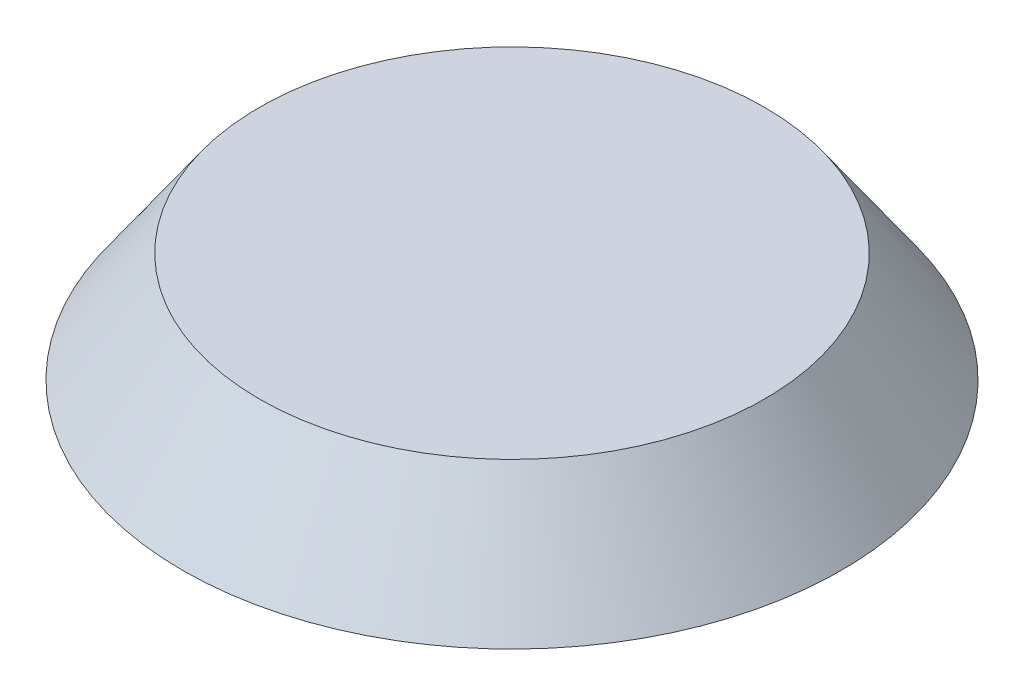
ISO-10303-21;
HEADER;
FILE_DESCRIPTION(('STEP AP214'),'2;1');
FILE_NAME('part.step','',(''),(''),'','','');
FILE_SCHEMA(('AUTOMOTIVE_DESIGN { 1 0 10303 214 1 1 1 1 }'));
ENDSEC;
DATA;
#1=APPLICATION_CONTEXT('core data for automotive mechanical design processes');
#2=APPLICATION_PROTOCOL_DEFINITION('international standard','automotive_design',2000,#1);
#3=PRODUCT_CONTEXT('',#1,'mechanical');
#4=PRODUCT('Part','Part','',(#3));
#5=PRODUCT_RELATED_PRODUCT_CATEGORY('part','',(#4));
#6=PRODUCT_DEFINITION_FORMATION('','',#4);
#7=PRODUCT_DEFINITION_CONTEXT('part definition',#1,'design');
#8=PRODUCT_DEFINITION('design','',#6,#7);
#9=PRODUCT_DEFINITION_SHAPE('','',#8);
#10=(LENGTH_UNIT() NAMED_UNIT(*) SI_UNIT(.MILLI.,.METRE.));
#11=(NAMED_UNIT(*) PLANE_ANGLE_UNIT() SI_UNIT($,.RADIAN.));
#12=(NAMED_UNIT(*) SI_UNIT($,.STERADIAN.) SOLID_ANGLE_UNIT());
#13=UNCERTAINTY_MEASURE_WITH_UNIT(LENGTH_MEASURE(1.E-05),#10,'distance_accuracy_value','');
#14=(GEOMETRIC_REPRESENTATION_CONTEXT(3) GLOBAL_UNCERTAINTY_ASSIGNED_CONTEXT((#13)) GLOBAL_UNIT_ASSIGNED_CONTEXT((#10,
#11,#12)) REPRESENTATION_CONTEXT('',''));
#15=CARTESIAN_POINT('',(0.,0.,0.));
#16=DIRECTION('',(0.,0.,1.));
#17=DIRECTION('',(1.,0.,0.));
#18=AXIS2_PLACEMENT_3D('',#15,#16,#17);
#19=CARTESIAN_POINT('',(0.,10.,0.));
#20=DIRECTION('',(0.,1.,0.));
#21=DIRECTION('',(0.,0.,1.));
#22=AXIS2_PLACEMENT_3D('',#19,#20,#21);
#23=PLANE('',#22);
#24=CARTESIAN_POINT('',(0.,10.,0.));
#25=DIRECTION('',(0.,1.,0.));
#26=DIRECTION('',(0.,0.,1.));
#27=AXIS2_PLACEMENT_3D('',#24,#25,#26);
#28=CIRCLE('',#27,22.9979246179029);
#29=CARTESIAN_POINT('',(0.,10.,22.9979246179029));
#30=VERTEX_POINT('',#29);
#31=EDGE_CURVE('E57',#30,#30,#28,.T.);
#32=ORIENTED_EDGE('',*,*,#31,.T.);
#33=EDGE_LOOP('',(#32));
#34=FACE_BOUND('',#33,.T.);
#35=ADVANCED_FACE('F31',(#34),#23,.T.);
#36=CARTESIAN_POINT('',(0.,0.,0.));
#37=DIRECTION('',(0.,1.,0.));
#38=DIRECTION('',(0.,0.,1.));
#39=AXIS2_PLACEMENT_3D('',#36,#37,#38);
#40=PLANE('',#39);
#41=CARTESIAN_POINT('',(0.,0.,0.));
#42=DIRECTION('',(0.,1.,0.));
#43=DIRECTION('',(0.,0.,1.));
#44=AXIS2_PLACEMENT_3D('',#41,#42,#43);
#45=CIRCLE('',#44,28.1688381168578);
#46=CARTESIAN_POINT('',(0.,0.,28.1688381168578));
#47=VERTEX_POINT('',#46);
#48=EDGE_CURVE('E64',#47,#47,#45,.T.);
#49=ORIENTED_EDGE('',*,*,#48,.T.);
#50=EDGE_LOOP('',(#49));
#51=FACE_BOUND('',#50,.T.);
#52=CARTESIAN_POINT('',(0.,0.,0.));
#53=DIRECTION('',(0.,1.,0.));
#54=DIRECTION('',(0.,0.,1.));
#55=AXIS2_PLACEMENT_3D('',#52,#53,#54);
#56=CIRCLE('',#55,30.);
#57=CARTESIAN_POINT('',(0.,0.,30.));
#58=VERTEX_POINT('',#57);
#59=EDGE_CURVE('E60',#58,#58,#56,.T.);
#60=ORIENTED_EDGE('',*,*,#59,.F.);
#61=EDGE_LOOP('',(#60));
#62=FACE_BOUND('',#61,.T.);
#63=ADVANCED_FACE('F112',(#51,#62),#40,.F.);
#64=CARTESIAN_POINT('',(0.,10.,0.));
#65=DIRECTION('',(0.,-1.,0.));
#66=DIRECTION('',(0.,0.,-1.));
#67=AXIS2_PLACEMENT_3D('',#64,#65,#66);
#68=CONICAL_SURFACE('',#67,22.9979246179029,0.610865238198013);
#69=ORIENTED_EDGE('',*,*,#59,.T.);
#70=EDGE_LOOP('',(#69));
#71=FACE_BOUND('',#70,.T.);
#72=ORIENTED_EDGE('',*,*,#31,.F.);
#73=EDGE_LOOP('',(#72));
#74=FACE_BOUND('',#73,.T.);
#75=ADVANCED_FACE('F118',(#71,#74),#68,.T.);
#76=CARTESIAN_POINT('',(0.,8.5,0.));
#77=DIRECTION('',(0.,1.,0.));
#78=DIRECTION('',(0.,0.,1.));
#79=AXIS2_PLACEMENT_3D('',#76,#77,#78);
#80=PLANE('',#79);
#81=CARTESIAN_POINT('',(7.99999999999987,8.5,-13.8564064605511));
#82=DIRECTION('',(0.,1.,0.));
#83=DIRECTION('',(0.,0.,1.));
#84=AXIS2_PLACEMENT_3D('',#81,#82,#83);
#85=CIRCLE('',#84,4.);
#86=CARTESIAN_POINT('',(7.99999999999987,8.5,-9.85640646055109));
#87=VERTEX_POINT('',#86);
#88=EDGE_CURVE('E42',#87,#87,#85,.F.);
#89=ORIENTED_EDGE('',*,*,#88,.F.);
#90=EDGE_LOOP('',(#89));
#91=FACE_BOUND('',#90,.T.);
#92=CARTESIAN_POINT('',(8.00000000000007,8.5,13.856406460551));
#93=DIRECTION('',(0.,1.,0.));
#94=DIRECTION('',(0.,0.,1.));
#95=AXIS2_PLACEMENT_3D('',#92,#93,#94);
#96=CIRCLE('',#95,4.);
#97=CARTESIAN_POINT('',(8.00000000000007,8.5,17.856406460551));
#98=VERTEX_POINT('',#97);
#99=EDGE_CURVE('E46',#98,#98,#96,.F.);
#100=ORIENTED_EDGE('',*,*,#99,.F.);
#101=EDGE_LOOP('',(#100));
#102=FACE_BOUND('',#101,.T.);
#103=CARTESIAN_POINT('',(-16.,8.5,0.));
#104=DIRECTION('',(0.,1.,0.));
#105=DIRECTION('',(0.,0.,1.));
#106=AXIS2_PLACEMENT_3D('',#103,#104,#105);
#107=CIRCLE('',#106,4.);
#108=CARTESIAN_POINT('',(-16.,8.5,4.));
#109=VERTEX_POINT('',#108);
#110=EDGE_CURVE('E54',#109,#109,#107,.F.);
#111=ORIENTED_EDGE('',*,*,#110,.F.);
#112=EDGE_LOOP('',(#111));
#113=FACE_BOUND('',#112,.T.);
#114=CARTESIAN_POINT('',(0.,8.5,0.));
#115=DIRECTION('',(0.,1.,0.));
#116=DIRECTION('',(0.,0.,1.));
#117=AXIS2_PLACEMENT_3D('',#114,#115,#116);
#118=CIRCLE('',#117,22.2170740420753);
#119=CARTESIAN_POINT('',(0.,8.5,22.2170740420753));
#120=VERTEX_POINT('',#119);
#121=EDGE_CURVE('E63',#120,#120,#118,.T.);
#122=ORIENTED_EDGE('',*,*,#121,.F.);
#123=EDGE_LOOP('',(#122));
#124=FACE_BOUND('',#123,.T.);
#125=ADVANCED_FACE('F127',(#91,#102,#113,#124),#80,.F.);
#126=CARTESIAN_POINT('',(0.,9.13963534547343,0.));
#127=DIRECTION('',(0.,-1.,0.));
#128=DIRECTION('',(0.,0.,-1.));
#129=AXIS2_PLACEMENT_3D('',#126,#127,#128);
#130=CONICAL_SURFACE('',#129,21.7691965514694,0.610865238198013);
#131=ORIENTED_EDGE('',*,*,#48,.F.);
#132=EDGE_LOOP('',(#131));
#133=FACE_BOUND('',#132,.T.);
#134=ORIENTED_EDGE('',*,*,#121,.T.);
#135=EDGE_LOOP('',(#134));
#136=FACE_BOUND('',#135,.T.);
#137=ADVANCED_FACE('F122',(#133,#136),#130,.F.);
#138=CARTESIAN_POINT('',(-16.,0.,0.));
#139=DIRECTION('',(0.,-1.,0.));
#140=DIRECTION('',(0.,0.,-1.));
#141=AXIS2_PLACEMENT_3D('',#138,#139,#140);
#142=PLANE('',#141);
#143=CARTESIAN_POINT('',(-16.,0.,0.));
#144=DIRECTION('',(0.,-1.,0.));
#145=DIRECTION('',(0.,0.,-1.));
#146=AXIS2_PLACEMENT_3D('',#143,#144,#145);
#147=CIRCLE('',#146,2.55453387609415);
#148=CARTESIAN_POINT('',(-16.,0.,-2.55453387609415));
#149=VERTEX_POINT('',#148);
#150=EDGE_CURVE('E70',#149,#149,#147,.T.);
#151=ORIENTED_EDGE('',*,*,#150,.F.);
#152=EDGE_LOOP('',(#151));
#153=FACE_BOUND('',#152,.T.);
#154=CARTESIAN_POINT('',(-16.,0.,0.));
#155=DIRECTION('',(0.,-1.,0.));
#156=DIRECTION('',(0.,0.,-1.));
#157=AXIS2_PLACEMENT_3D('',#154,#155,#156);
#158=CIRCLE('',#157,3.55453387609415);
#159=CARTESIAN_POINT('',(-16.,0.,-3.55453387609415));
#160=VERTEX_POINT('',#159);
#161=EDGE_CURVE('E51',#160,#160,#158,.T.);
#162=ORIENTED_EDGE('',*,*,#161,.T.);
#163=EDGE_LOOP('',(#162));
#164=FACE_BOUND('',#163,.T.);
#165=ADVANCED_FACE('F132',(#153,#164),#142,.T.);
#166=CARTESIAN_POINT('',(-16.,0.,0.));
#167=DIRECTION('',(0.,1.,0.));
#168=DIRECTION('',(0.,0.,1.));
#169=AXIS2_PLACEMENT_3D('',#166,#167,#168);
#170=CONICAL_SURFACE('',#169,3.55453387609415,0.0523598775598264);
#171=ORIENTED_EDGE('',*,*,#110,.T.);
#172=EDGE_LOOP('',(#171));
#173=FACE_BOUND('',#172,.T.);
#174=ORIENTED_EDGE('',*,*,#161,.F.);
#175=EDGE_LOOP('',(#174));
#176=FACE_BOUND('',#175,.T.);
#177=ADVANCED_FACE('F129',(#173,#176),#170,.T.);
#178=CARTESIAN_POINT('',(-16.,8.5,0.));
#179=DIRECTION('',(0.,-1.,0.));
#180=DIRECTION('',(0.,0.,-1.));
#181=AXIS2_PLACEMENT_3D('',#178,#179,#180);
#182=CYLINDRICAL_SURFACE('',#181,2.55453387609415);
#183=CARTESIAN_POINT('',(-16.,8.5,0.));
#184=DIRECTION('',(0.,-1.,0.));
#185=DIRECTION('',(0.,0.,-1.));
#186=AXIS2_PLACEMENT_3D('',#183,#184,#185);
#187=CIRCLE('',#186,2.55453387609415);
#188=CARTESIAN_POINT('',(-16.,8.5,-2.55453387609415));
#189=VERTEX_POINT('',#188);
#190=EDGE_CURVE('E67',#189,#189,#187,.T.);
#191=ORIENTED_EDGE('',*,*,#190,.F.);
#192=EDGE_LOOP('',(#191));
#193=FACE_BOUND('',#192,.T.);
#194=ORIENTED_EDGE('',*,*,#150,.T.);
#195=EDGE_LOOP('',(#194));
#196=FACE_BOUND('',#195,.T.);
#197=ADVANCED_FACE('F131',(#193,#196),#182,.F.);
#198=CARTESIAN_POINT('',(-16.,8.5,0.));
#199=DIRECTION('',(0.,-1.,0.));
#200=DIRECTION('',(0.,0.,-1.));
#201=AXIS2_PLACEMENT_3D('',#198,#199,#200);
#202=PLANE('',#201);
#203=ORIENTED_EDGE('',*,*,#190,.T.);
#204=EDGE_LOOP('',(#203));
#205=FACE_BOUND('',#204,.T.);
#206=ADVANCED_FACE('F107',(#205),#202,.T.);
#207=CARTESIAN_POINT('',(8.00000000000007,0.,13.856406460551));
#208=DIRECTION('',(0.,-1.,0.));
#209=DIRECTION('',(-0.866025403784436,0.,0.500000000000004));
#210=AXIS2_PLACEMENT_3D('',#207,#208,#209);
#211=PLANE('',#210);
#212=CARTESIAN_POINT('',(8.00000000000007,0.,13.856406460551));
#213=DIRECTION('',(0.,-1.,0.));
#214=DIRECTION('',(-0.866025403784436,0.,0.500000000000004));
#215=AXIS2_PLACEMENT_3D('',#212,#213,#214);
#216=CIRCLE('',#215,2.55453387609415);
#217=CARTESIAN_POINT('',(5.78770876847461,0.,15.1336733985981));
#218=VERTEX_POINT('',#217);
#219=EDGE_CURVE('E76',#218,#218,#216,.T.);
#220=ORIENTED_EDGE('',*,*,#219,.F.);
#221=EDGE_LOOP('',(#220));
#222=FACE_BOUND('',#221,.T.);
#223=CARTESIAN_POINT('',(8.00000000000007,0.,13.856406460551));
#224=DIRECTION('',(0.,-1.,0.));
#225=DIRECTION('',(0.,0.,-1.));
#226=AXIS2_PLACEMENT_3D('',#223,#224,#225);
#227=CIRCLE('',#226,3.55453387609415);
#228=CARTESIAN_POINT('',(8.00000000000007,0.,10.3018725844568));
#229=VERTEX_POINT('',#228);
#230=EDGE_CURVE('E38',#229,#229,#227,.T.);
#231=ORIENTED_EDGE('',*,*,#230,.T.);
#232=EDGE_LOOP('',(#231));
#233=FACE_BOUND('',#232,.T.);
#234=ADVANCED_FACE('F100',(#222,#233),#211,.T.);
#235=CARTESIAN_POINT('',(7.99999999999987,0.,-13.8564064605511));
#236=DIRECTION('',(0.,-1.,0.));
#237=DIRECTION('',(0.866025403784443,0.,0.499999999999992));
#238=AXIS2_PLACEMENT_3D('',#235,#236,#237);
#239=PLANE('',#238);
#240=CARTESIAN_POINT('',(7.99999999999987,0.,-13.8564064605511));
#241=DIRECTION('',(0.,-1.,0.));
#242=DIRECTION('',(0.866025403784443,0.,0.499999999999992));
#243=AXIS2_PLACEMENT_3D('',#240,#241,#242);
#244=CIRCLE('',#243,2.55453387609415);
#245=CARTESIAN_POINT('',(10.2122912315253,0.,-12.579139522504));
#246=VERTEX_POINT('',#245);
#247=EDGE_CURVE('E82',#246,#246,#244,.T.);
#248=ORIENTED_EDGE('',*,*,#247,.F.);
#249=EDGE_LOOP('',(#248));
#250=FACE_BOUND('',#249,.T.);
#251=CARTESIAN_POINT('',(7.99999999999987,0.,-13.8564064605511));
#252=DIRECTION('',(0.,-1.,0.));
#253=DIRECTION('',(0.,0.,-1.));
#254=AXIS2_PLACEMENT_3D('',#251,#252,#253);
#255=CIRCLE('',#254,3.55453387609417);
#256=CARTESIAN_POINT('',(7.99999999999987,0.,-17.4109403366453));
#257=VERTEX_POINT('',#256);
#258=EDGE_CURVE('E10',#257,#257,#255,.T.);
#259=ORIENTED_EDGE('',*,*,#258,.T.);
#260=EDGE_LOOP('',(#259));
#261=FACE_BOUND('',#260,.T.);
#262=ADVANCED_FACE('F97',(#250,#261),#239,.T.);
#263=CARTESIAN_POINT('',(8.00000000000007,0.,13.856406460551));
#264=DIRECTION('',(0.,1.,0.));
#265=DIRECTION('',(0.,0.,1.));
#266=AXIS2_PLACEMENT_3D('',#263,#264,#265);
#267=CONICAL_SURFACE('',#266,3.55453387609415,0.0523598775598266);
#268=ORIENTED_EDGE('',*,*,#99,.T.);
#269=EDGE_LOOP('',(#268));
#270=FACE_BOUND('',#269,.T.);
#271=ORIENTED_EDGE('',*,*,#230,.F.);
#272=EDGE_LOOP('',(#271));
#273=FACE_BOUND('',#272,.T.);
#274=ADVANCED_FACE('F99',(#270,#273),#267,.T.);
#275=CARTESIAN_POINT('',(7.99999999999987,0.,-13.8564064605511));
#276=DIRECTION('',(0.,1.,0.));
#277=DIRECTION('',(0.,0.,1.));
#278=AXIS2_PLACEMENT_3D('',#275,#276,#277);
#279=CONICAL_SURFACE('',#278,3.55453387609417,0.0523598775598267);
#280=ORIENTED_EDGE('',*,*,#88,.T.);
#281=EDGE_LOOP('',(#280));
#282=FACE_BOUND('',#281,.T.);
#283=ORIENTED_EDGE('',*,*,#258,.F.);
#284=EDGE_LOOP('',(#283));
#285=FACE_BOUND('',#284,.T.);
#286=ADVANCED_FACE('F33',(#282,#285),#279,.T.);
#287=CARTESIAN_POINT('',(8.00000000000007,8.5,13.856406460551));
#288=DIRECTION('',(0.,-1.,0.));
#289=DIRECTION('',(0.,0.,-1.));
#290=AXIS2_PLACEMENT_3D('',#287,#288,#289);
#291=CYLINDRICAL_SURFACE('',#290,2.55453387609415);
#292=CARTESIAN_POINT('',(8.00000000000007,8.5,13.856406460551));
#293=DIRECTION('',(0.,-1.,0.));
#294=DIRECTION('',(-0.866025403784436,0.,0.500000000000004));
#295=AXIS2_PLACEMENT_3D('',#292,#293,#294);
#296=CIRCLE('',#295,2.55453387609415);
#297=CARTESIAN_POINT('',(5.78770876847461,8.5,15.1336733985981));
#298=VERTEX_POINT('',#297);
#299=EDGE_CURVE('E73',#298,#298,#296,.T.);
#300=ORIENTED_EDGE('',*,*,#299,.F.);
#301=EDGE_LOOP('',(#300));
#302=FACE_BOUND('',#301,.T.);
#303=ORIENTED_EDGE('',*,*,#219,.T.);
#304=EDGE_LOOP('',(#303));
#305=FACE_BOUND('',#304,.T.);
#306=ADVANCED_FACE('F215',(#302,#305),#291,.F.);
#307=CARTESIAN_POINT('',(8.00000000000007,8.5,13.856406460551));
#308=DIRECTION('',(0.,-1.,0.));
#309=DIRECTION('',(-0.866025403784436,0.,0.500000000000004));
#310=AXIS2_PLACEMENT_3D('',#307,#308,#309);
#311=PLANE('',#310);
#312=ORIENTED_EDGE('',*,*,#299,.T.);
#313=EDGE_LOOP('',(#312));
#314=FACE_BOUND('',#313,.T.);
#315=ADVANCED_FACE('F93',(#314),#311,.T.);
#316=CARTESIAN_POINT('',(7.99999999999987,8.5,-13.8564064605511));
#317=DIRECTION('',(0.,-1.,0.));
#318=DIRECTION('',(0.,0.,-1.));
#319=AXIS2_PLACEMENT_3D('',#316,#317,#318);
#320=CYLINDRICAL_SURFACE('',#319,2.55453387609415);
#321=CARTESIAN_POINT('',(7.99999999999987,8.5,-13.8564064605511));
#322=DIRECTION('',(0.,-1.,0.));
#323=DIRECTION('',(0.866025403784443,0.,0.499999999999992));
#324=AXIS2_PLACEMENT_3D('',#321,#322,#323);
#325=CIRCLE('',#324,2.55453387609415);
#326=CARTESIAN_POINT('',(10.2122912315253,8.5,-12.579139522504));
#327=VERTEX_POINT('',#326);
#328=EDGE_CURVE('E79',#327,#327,#325,.T.);
#329=ORIENTED_EDGE('',*,*,#328,.F.);
#330=EDGE_LOOP('',(#329));
#331=FACE_BOUND('',#330,.T.);
#332=ORIENTED_EDGE('',*,*,#247,.T.);
#333=EDGE_LOOP('',(#332));
#334=FACE_BOUND('',#333,.T.);
#335=ADVANCED_FACE('F90',(#331,#334),#320,.F.);
#336=CARTESIAN_POINT('',(7.99999999999987,8.5,-13.8564064605511));
#337=DIRECTION('',(0.,-1.,0.));
#338=DIRECTION('',(0.866025403784443,0.,0.499999999999992));
#339=AXIS2_PLACEMENT_3D('',#336,#337,#338);
#340=PLANE('',#339);
#341=ORIENTED_EDGE('',*,*,#328,.T.);
#342=EDGE_LOOP('',(#341));
#343=FACE_BOUND('',#342,.T.);
#344=ADVANCED_FACE('F88',(#343),#340,.T.);
#345=CLOSED_SHELL('',(#35,#63,#75,#125,#137,#165,#177,#197,#206,#234,#262,#274,#286,#306,#315,
#335,#344));
#346=MANIFOLD_SOLID_BREP('B2',#345);
#347=ADVANCED_BREP_SHAPE_REPRESENTATION('',(#18,#346),#14);
#348=SHAPE_DEFINITION_REPRESENTATION(#9,#347);
ENDSEC;
END-ISO-10303-21;
